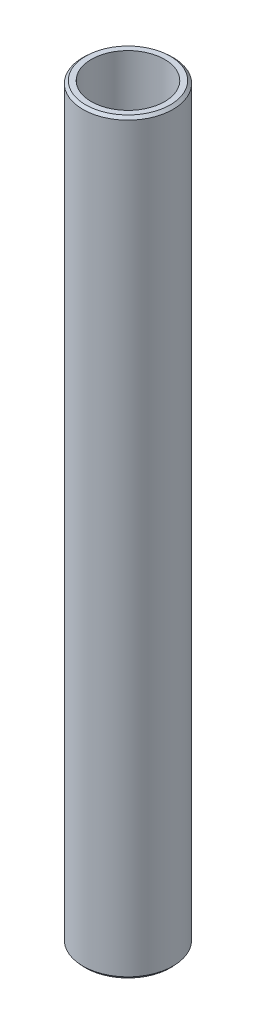
ISO-10303-21;
HEADER;
FILE_DESCRIPTION(('STEP AP214'),'2;1');
FILE_NAME('part.step','',(''),(''),'','','');
FILE_SCHEMA(('AUTOMOTIVE_DESIGN { 1 0 10303 214 1 1 1 1 }'));
ENDSEC;
DATA;
#1=APPLICATION_CONTEXT('core data for automotive mechanical design processes');
#2=APPLICATION_PROTOCOL_DEFINITION('international standard','automotive_design',2000,#1);
#3=PRODUCT_CONTEXT('',#1,'mechanical');
#4=PRODUCT('Part','Part','',(#3));
#5=PRODUCT_RELATED_PRODUCT_CATEGORY('part','',(#4));
#6=PRODUCT_DEFINITION_FORMATION('','',#4);
#7=PRODUCT_DEFINITION_CONTEXT('part definition',#1,'design');
#8=PRODUCT_DEFINITION('design','',#6,#7);
#9=PRODUCT_DEFINITION_SHAPE('','',#8);
#10=(LENGTH_UNIT() NAMED_UNIT(*) SI_UNIT(.MILLI.,.METRE.));
#11=(NAMED_UNIT(*) PLANE_ANGLE_UNIT() SI_UNIT($,.RADIAN.));
#12=(NAMED_UNIT(*) SI_UNIT($,.STERADIAN.) SOLID_ANGLE_UNIT());
#13=UNCERTAINTY_MEASURE_WITH_UNIT(LENGTH_MEASURE(1.E-05),#10,'distance_accuracy_value','');
#14=(GEOMETRIC_REPRESENTATION_CONTEXT(3) GLOBAL_UNCERTAINTY_ASSIGNED_CONTEXT((#13)) GLOBAL_UNIT_ASSIGNED_CONTEXT((#10,
#11,#12)) REPRESENTATION_CONTEXT('',''));
#15=CARTESIAN_POINT('',(0.,0.,0.));
#16=DIRECTION('',(0.,0.,1.));
#17=DIRECTION('',(1.,0.,0.));
#18=AXIS2_PLACEMENT_3D('',#15,#16,#17);
#19=CARTESIAN_POINT('',(0.,373.312115991474,0.));
#20=DIRECTION('',(0.,-1.,0.));
#21=DIRECTION('',(0.,0.,-1.));
#22=AXIS2_PLACEMENT_3D('',#19,#20,#21);
#23=CYLINDRICAL_SURFACE('',#22,22.5);
#24=CARTESIAN_POINT('',(0.,372.045047000731,0.));
#25=DIRECTION('',(0.,1.,0.));
#26=DIRECTION('',(0.,0.,1.));
#27=AXIS2_PLACEMENT_3D('',#24,#25,#26);
#28=CIRCLE('',#27,22.5);
#29=CARTESIAN_POINT('',(0.,372.045047000731,22.5));
#30=VERTEX_POINT('',#29);
#31=EDGE_CURVE('E50',#30,#30,#28,.F.);
#32=ORIENTED_EDGE('',*,*,#31,.T.);
#33=EDGE_LOOP('',(#32));
#34=FACE_BOUND('',#33,.T.);
#35=CARTESIAN_POINT('',(0.,1.39299799102505,0.));
#36=DIRECTION('',(0.,1.,0.));
#37=DIRECTION('',(0.,0.,1.));
#38=AXIS2_PLACEMENT_3D('',#35,#36,#37);
#39=CIRCLE('',#38,22.5);
#40=CARTESIAN_POINT('',(0.,1.39299799102505,22.5));
#41=VERTEX_POINT('',#40);
#42=EDGE_CURVE('E51',#41,#41,#39,.T.);
#43=ORIENTED_EDGE('',*,*,#42,.T.);
#44=EDGE_LOOP('',(#43));
#45=FACE_BOUND('',#44,.T.);
#46=ADVANCED_FACE('F39',(#34,#45),#23,.T.);
#47=CARTESIAN_POINT('',(0.,373.312115991474,0.));
#48=DIRECTION('',(0.,1.,0.));
#49=DIRECTION('',(0.,0.,1.));
#50=AXIS2_PLACEMENT_3D('',#47,#48,#49);
#51=PLANE('',#50);
#52=CARTESIAN_POINT('',(0.,373.312115991474,0.));
#53=DIRECTION('',(0.,1.,0.));
#54=DIRECTION('',(0.,0.,1.));
#55=AXIS2_PLACEMENT_3D('',#52,#53,#54);
#56=CIRCLE('',#55,21.107002008975);
#57=CARTESIAN_POINT('',(0.,373.312115991474,21.107002008975));
#58=VERTEX_POINT('',#57);
#59=EDGE_CURVE('E54',#58,#58,#56,.T.);
#60=ORIENTED_EDGE('',*,*,#59,.T.);
#61=EDGE_LOOP('',(#60));
#62=FACE_BOUND('',#61,.T.);
#63=CARTESIAN_POINT('',(0.,373.312115991474,0.));
#64=DIRECTION('',(0.,1.,0.));
#65=DIRECTION('',(0.,0.,1.));
#66=AXIS2_PLACEMENT_3D('',#63,#64,#65);
#67=CIRCLE('',#66,18.3124971184795);
#68=CARTESIAN_POINT('',(0.,373.312115991474,18.3124971184795));
#69=VERTEX_POINT('',#68);
#70=EDGE_CURVE('E58',#69,#69,#67,.T.);
#71=ORIENTED_EDGE('',*,*,#70,.F.);
#72=EDGE_LOOP('',(#71));
#73=FACE_BOUND('',#72,.T.);
#74=ADVANCED_FACE('F69',(#62,#73),#51,.T.);
#75=CARTESIAN_POINT('',(0.,0.,0.));
#76=DIRECTION('',(0.,1.,0.));
#77=DIRECTION('',(0.,0.,1.));
#78=AXIS2_PLACEMENT_3D('',#75,#76,#77);
#79=PLANE('',#78);
#80=CARTESIAN_POINT('',(0.,0.,0.));
#81=DIRECTION('',(0.,1.,0.));
#82=DIRECTION('',(0.,0.,1.));
#83=AXIS2_PLACEMENT_3D('',#80,#81,#82);
#84=CIRCLE('',#83,21.2329310092571);
#85=CARTESIAN_POINT('',(0.,0.,21.2329310092571));
#86=VERTEX_POINT('',#85);
#87=EDGE_CURVE('E10',#86,#86,#84,.F.);
#88=ORIENTED_EDGE('',*,*,#87,.T.);
#89=EDGE_LOOP('',(#88));
#90=FACE_BOUND('',#89,.T.);
#91=CARTESIAN_POINT('',(0.,0.,0.));
#92=DIRECTION('',(0.,1.,0.));
#93=DIRECTION('',(0.,0.,1.));
#94=AXIS2_PLACEMENT_3D('',#91,#92,#93);
#95=CIRCLE('',#94,18.3124971184795);
#96=CARTESIAN_POINT('',(0.,0.,18.3124971184795));
#97=VERTEX_POINT('',#96);
#98=EDGE_CURVE('E63',#97,#97,#95,.T.);
#99=ORIENTED_EDGE('',*,*,#98,.T.);
#100=EDGE_LOOP('',(#99));
#101=FACE_BOUND('',#100,.T.);
#102=ADVANCED_FACE('F75',(#90,#101),#79,.F.);
#103=CARTESIAN_POINT('',(0.,373.312115991474,0.));
#104=DIRECTION('',(0.,-1.,0.));
#105=DIRECTION('',(0.,0.,-1.));
#106=AXIS2_PLACEMENT_3D('',#103,#104,#105);
#107=CYLINDRICAL_SURFACE('',#106,18.3124971184795);
#108=ORIENTED_EDGE('',*,*,#70,.T.);
#109=EDGE_LOOP('',(#108));
#110=FACE_BOUND('',#109,.T.);
#111=ORIENTED_EDGE('',*,*,#98,.F.);
#112=EDGE_LOOP('',(#111));
#113=FACE_BOUND('',#112,.T.);
#114=ADVANCED_FACE('F70',(#110,#113),#107,.F.);
#115=CARTESIAN_POINT('',(0.,373.312115991474,0.));
#116=DIRECTION('',(0.,-1.,0.));
#117=DIRECTION('',(0.,0.,-1.));
#118=AXIS2_PLACEMENT_3D('',#115,#116,#117);
#119=CONICAL_SURFACE('',#118,21.107002008975,0.832703382841013);
#120=ORIENTED_EDGE('',*,*,#31,.F.);
#121=EDGE_LOOP('',(#120));
#122=FACE_BOUND('',#121,.T.);
#123=ORIENTED_EDGE('',*,*,#59,.F.);
#124=EDGE_LOOP('',(#123));
#125=FACE_BOUND('',#124,.T.);
#126=ADVANCED_FACE('F81',(#122,#125),#119,.T.);
#127=CARTESIAN_POINT('',(0.,1.39299799102505,0.));
#128=DIRECTION('',(0.,1.,0.));
#129=DIRECTION('',(0.,0.,1.));
#130=AXIS2_PLACEMENT_3D('',#127,#128,#129);
#131=CONICAL_SURFACE('',#130,22.5,0.738092943953871);
#132=ORIENTED_EDGE('',*,*,#87,.F.);
#133=EDGE_LOOP('',(#132));
#134=FACE_BOUND('',#133,.T.);
#135=ORIENTED_EDGE('',*,*,#42,.F.);
#136=EDGE_LOOP('',(#135));
#137=FACE_BOUND('',#136,.T.);
#138=ADVANCED_FACE('F45',(#134,#137),#131,.T.);
#139=CLOSED_SHELL('',(#46,#74,#102,#114,#126,#138));
#140=MANIFOLD_SOLID_BREP('B2',#139);
#141=ADVANCED_BREP_SHAPE_REPRESENTATION('',(#18,#140),#14);
#142=SHAPE_DEFINITION_REPRESENTATION(#9,#141);
ENDSEC;
END-ISO-10303-21;
